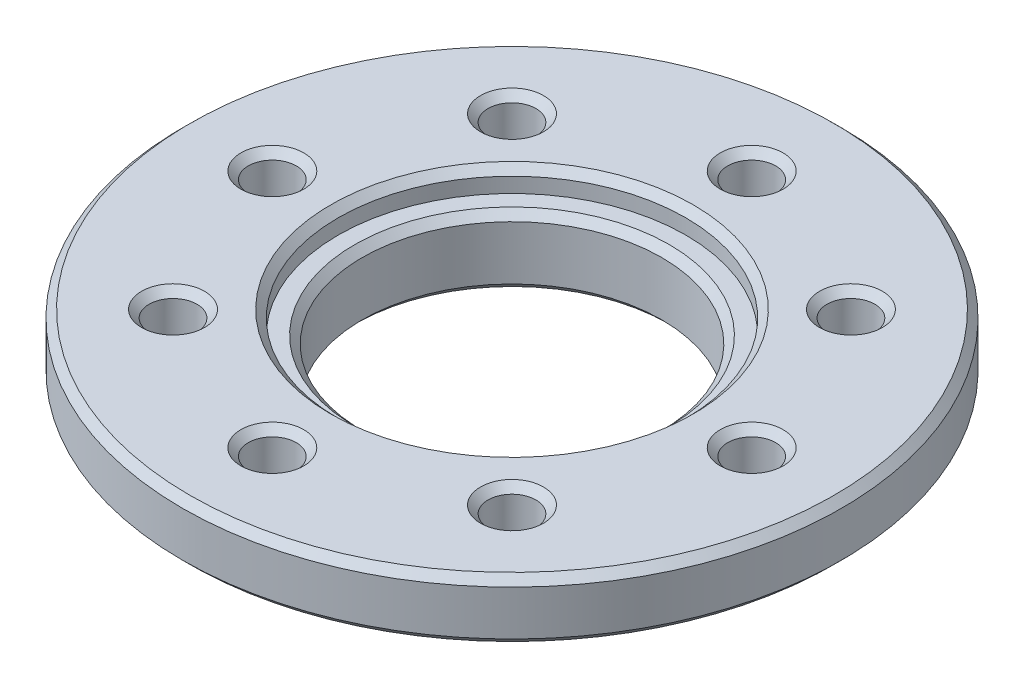
ISO-10303-21;
HEADER;
FILE_DESCRIPTION(('STEP AP214'),'2;1');
FILE_NAME('part.step','',(''),(''),'','','');
FILE_SCHEMA(('AUTOMOTIVE_DESIGN { 1 0 10303 214 1 1 1 1 }'));
ENDSEC;
DATA;
#1=APPLICATION_CONTEXT('core data for automotive mechanical design processes');
#2=APPLICATION_PROTOCOL_DEFINITION('international standard','automotive_design',2000,#1);
#3=PRODUCT_CONTEXT('',#1,'mechanical');
#4=PRODUCT('Part','Part','',(#3));
#5=PRODUCT_RELATED_PRODUCT_CATEGORY('part','',(#4));
#6=PRODUCT_DEFINITION_FORMATION('','',#4);
#7=PRODUCT_DEFINITION_CONTEXT('part definition',#1,'design');
#8=PRODUCT_DEFINITION('design','',#6,#7);
#9=PRODUCT_DEFINITION_SHAPE('','',#8);
#10=(LENGTH_UNIT() NAMED_UNIT(*) SI_UNIT(.MILLI.,.METRE.));
#11=(NAMED_UNIT(*) PLANE_ANGLE_UNIT() SI_UNIT($,.RADIAN.));
#12=(NAMED_UNIT(*) SI_UNIT($,.STERADIAN.) SOLID_ANGLE_UNIT());
#13=UNCERTAINTY_MEASURE_WITH_UNIT(LENGTH_MEASURE(1.E-05),#10,'distance_accuracy_value','');
#14=(GEOMETRIC_REPRESENTATION_CONTEXT(3) GLOBAL_UNCERTAINTY_ASSIGNED_CONTEXT((#13)) GLOBAL_UNIT_ASSIGNED_CONTEXT((#10,
#11,#12)) REPRESENTATION_CONTEXT('',''));
#15=CARTESIAN_POINT('',(0.,0.,0.));
#16=DIRECTION('',(0.,0.,1.));
#17=DIRECTION('',(1.,0.,0.));
#18=AXIS2_PLACEMENT_3D('',#15,#16,#17);
#19=CARTESIAN_POINT('',(0.,-2.,0.));
#20=DIRECTION('',(0.,-1.,0.));
#21=DIRECTION('',(0.,0.,-1.));
#22=AXIS2_PLACEMENT_3D('',#19,#20,#21);
#23=PLANE('',#22);
#24=CARTESIAN_POINT('',(0.,-2.,0.));
#25=DIRECTION('',(0.,-1.,0.));
#26=DIRECTION('',(0.,0.,-1.));
#27=AXIS2_PLACEMENT_3D('',#24,#25,#26);
#28=CIRCLE('',#27,10.7499999999956);
#29=CARTESIAN_POINT('',(0.,-2.,-10.7499999999956));
#30=VERTEX_POINT('',#29);
#31=EDGE_CURVE('E68',#30,#30,#28,.T.);
#32=ORIENTED_EDGE('',*,*,#31,.T.);
#33=EDGE_LOOP('',(#32));
#34=FACE_BOUND('',#33,.T.);
#35=CARTESIAN_POINT('',(0.,-2.,-8.));
#36=DIRECTION('',(0.,-1.,0.));
#37=DIRECTION('',(0.,0.,-1.));
#38=AXIS2_PLACEMENT_3D('',#35,#36,#37);
#39=CIRCLE('',#38,0.799999999999988);
#40=CARTESIAN_POINT('',(0.,-2.,-8.79999999999999));
#41=VERTEX_POINT('',#40);
#42=EDGE_CURVE('E146',#41,#41,#39,.T.);
#43=ORIENTED_EDGE('',*,*,#42,.F.);
#44=EDGE_LOOP('',(#43));
#45=FACE_BOUND('',#44,.T.);
#46=CARTESIAN_POINT('',(5.656854249492,-2.,-5.656854249492));
#47=DIRECTION('',(0.,-1.,0.));
#48=DIRECTION('',(0.,0.,-1.));
#49=AXIS2_PLACEMENT_3D('',#46,#47,#48);
#50=CIRCLE('',#49,0.799999999999988);
#51=CARTESIAN_POINT('',(5.656854249492,-2.,-6.45685424949199));
#52=VERTEX_POINT('',#51);
#53=EDGE_CURVE('E143',#52,#52,#50,.T.);
#54=ORIENTED_EDGE('',*,*,#53,.F.);
#55=EDGE_LOOP('',(#54));
#56=FACE_BOUND('',#55,.T.);
#57=CARTESIAN_POINT('',(8.,-2.,0.));
#58=DIRECTION('',(0.,-1.,0.));
#59=DIRECTION('',(0.,0.,-1.));
#60=AXIS2_PLACEMENT_3D('',#57,#58,#59);
#61=CIRCLE('',#60,0.799999999999988);
#62=CARTESIAN_POINT('',(8.,-2.,-0.799999999999988));
#63=VERTEX_POINT('',#62);
#64=EDGE_CURVE('E140',#63,#63,#61,.T.);
#65=ORIENTED_EDGE('',*,*,#64,.F.);
#66=EDGE_LOOP('',(#65));
#67=FACE_BOUND('',#66,.T.);
#68=CARTESIAN_POINT('',(5.656854249492,-2.,5.656854249492));
#69=DIRECTION('',(0.,-1.,0.));
#70=DIRECTION('',(0.,0.,-1.));
#71=AXIS2_PLACEMENT_3D('',#68,#69,#70);
#72=CIRCLE('',#71,0.799999999999988);
#73=CARTESIAN_POINT('',(5.656854249492,-2.,4.85685424949201));
#74=VERTEX_POINT('',#73);
#75=EDGE_CURVE('E137',#74,#74,#72,.T.);
#76=ORIENTED_EDGE('',*,*,#75,.F.);
#77=EDGE_LOOP('',(#76));
#78=FACE_BOUND('',#77,.T.);
#79=CARTESIAN_POINT('',(0.,-2.,8.));
#80=DIRECTION('',(0.,-1.,0.));
#81=DIRECTION('',(0.,0.,-1.));
#82=AXIS2_PLACEMENT_3D('',#79,#80,#81);
#83=CIRCLE('',#82,0.799999999999988);
#84=CARTESIAN_POINT('',(0.,-2.,7.20000000000001));
#85=VERTEX_POINT('',#84);
#86=EDGE_CURVE('E134',#85,#85,#83,.T.);
#87=ORIENTED_EDGE('',*,*,#86,.F.);
#88=EDGE_LOOP('',(#87));
#89=FACE_BOUND('',#88,.T.);
#90=CARTESIAN_POINT('',(-5.656854249492,-2.,5.656854249492));
#91=DIRECTION('',(0.,-1.,0.));
#92=DIRECTION('',(0.,0.,-1.));
#93=AXIS2_PLACEMENT_3D('',#90,#91,#92);
#94=CIRCLE('',#93,0.799999999999988);
#95=CARTESIAN_POINT('',(-5.656854249492,-2.,4.85685424949201));
#96=VERTEX_POINT('',#95);
#97=EDGE_CURVE('E131',#96,#96,#94,.T.);
#98=ORIENTED_EDGE('',*,*,#97,.F.);
#99=EDGE_LOOP('',(#98));
#100=FACE_BOUND('',#99,.T.);
#101=CARTESIAN_POINT('',(-8.,-2.,0.));
#102=DIRECTION('',(0.,-1.,0.));
#103=DIRECTION('',(0.,0.,-1.));
#104=AXIS2_PLACEMENT_3D('',#101,#102,#103);
#105=CIRCLE('',#104,0.799999999999988);
#106=CARTESIAN_POINT('',(-8.,-2.,-0.799999999999988));
#107=VERTEX_POINT('',#106);
#108=EDGE_CURVE('E128',#107,#107,#105,.T.);
#109=ORIENTED_EDGE('',*,*,#108,.F.);
#110=EDGE_LOOP('',(#109));
#111=FACE_BOUND('',#110,.T.);
#112=CARTESIAN_POINT('',(-5.656854249492,-2.,-5.656854249492));
#113=DIRECTION('',(0.,-1.,0.));
#114=DIRECTION('',(0.,0.,-1.));
#115=AXIS2_PLACEMENT_3D('',#112,#113,#114);
#116=CIRCLE('',#115,0.799999999999988);
#117=CARTESIAN_POINT('',(-5.656854249492,-2.,-6.45685424949199));
#118=VERTEX_POINT('',#117);
#119=EDGE_CURVE('E125',#118,#118,#116,.T.);
#120=ORIENTED_EDGE('',*,*,#119,.F.);
#121=EDGE_LOOP('',(#120));
#122=FACE_BOUND('',#121,.T.);
#123=CARTESIAN_POINT('',(0.,-2.,0.));
#124=DIRECTION('',(0.,-1.,0.));
#125=DIRECTION('',(0.,0.,-1.));
#126=AXIS2_PLACEMENT_3D('',#123,#124,#125);
#127=CIRCLE('',#126,6.25);
#128=CARTESIAN_POINT('',(0.,-2.,-6.25));
#129=VERTEX_POINT('',#128);
#130=EDGE_CURVE('E122',#129,#129,#127,.T.);
#131=ORIENTED_EDGE('',*,*,#130,.F.);
#132=EDGE_LOOP('',(#131));
#133=FACE_BOUND('',#132,.T.);
#134=ADVANCED_FACE('F30',(#34,#45,#56,#67,#78,#89,#100,#111,#122,#133),#23,.T.);
#135=CARTESIAN_POINT('',(0.,0.,0.));
#136=DIRECTION('',(0.,-1.,0.));
#137=DIRECTION('',(0.,0.,-1.));
#138=AXIS2_PLACEMENT_3D('',#135,#136,#137);
#139=CYLINDRICAL_SURFACE('',#138,11.);
#140=CARTESIAN_POINT('',(0.,-1.75000000005246,0.));
#141=DIRECTION('',(0.,-1.,0.));
#142=DIRECTION('',(0.,0.,-1.));
#143=AXIS2_PLACEMENT_3D('',#140,#141,#142);
#144=CIRCLE('',#143,11.);
#145=CARTESIAN_POINT('',(0.,-1.75000000005246,-11.));
#146=VERTEX_POINT('',#145);
#147=EDGE_CURVE('E62',#146,#146,#144,.F.);
#148=ORIENTED_EDGE('',*,*,#147,.T.);
#149=EDGE_LOOP('',(#148));
#150=FACE_BOUND('',#149,.T.);
#151=CARTESIAN_POINT('',(0.,-0.250000000004393,0.));
#152=DIRECTION('',(0.,1.,0.));
#153=DIRECTION('',(0.,0.,1.));
#154=AXIS2_PLACEMENT_3D('',#151,#152,#153);
#155=CIRCLE('',#154,11.);
#156=CARTESIAN_POINT('',(0.,-0.250000000004393,11.));
#157=VERTEX_POINT('',#156);
#158=EDGE_CURVE('E65',#157,#157,#155,.F.);
#159=ORIENTED_EDGE('',*,*,#158,.T.);
#160=EDGE_LOOP('',(#159));
#161=FACE_BOUND('',#160,.T.);
#162=ADVANCED_FACE('F170',(#150,#161),#139,.T.);
#163=CARTESIAN_POINT('',(11.,0.,0.));
#164=DIRECTION('',(0.,1.,0.));
#165=DIRECTION('',(0.,0.,1.));
#166=AXIS2_PLACEMENT_3D('',#163,#164,#165);
#167=PLANE('',#166);
#168=CARTESIAN_POINT('',(8.,0.,0.));
#169=DIRECTION('',(0.,1.,0.));
#170=DIRECTION('',(0.,0.,1.));
#171=AXIS2_PLACEMENT_3D('',#168,#169,#170);
#172=CIRCLE('',#171,1.04999999994754);
#173=CARTESIAN_POINT('',(8.,0.,1.04999999994754));
#174=VERTEX_POINT('',#173);
#175=EDGE_CURVE('E89',#174,#174,#172,.F.);
#176=ORIENTED_EDGE('',*,*,#175,.T.);
#177=EDGE_LOOP('',(#176));
#178=FACE_BOUND('',#177,.T.);
#179=CARTESIAN_POINT('',(-8.,0.,0.));
#180=DIRECTION('',(0.,1.,0.));
#181=DIRECTION('',(0.,0.,1.));
#182=AXIS2_PLACEMENT_3D('',#179,#180,#181);
#183=CIRCLE('',#182,1.04999999994754);
#184=CARTESIAN_POINT('',(-8.,0.,1.04999999994754));
#185=VERTEX_POINT('',#184);
#186=EDGE_CURVE('E92',#185,#185,#183,.F.);
#187=ORIENTED_EDGE('',*,*,#186,.T.);
#188=EDGE_LOOP('',(#187));
#189=FACE_BOUND('',#188,.T.);
#190=CARTESIAN_POINT('',(0.,0.,8.));
#191=DIRECTION('',(0.,1.,0.));
#192=DIRECTION('',(0.,0.,1.));
#193=AXIS2_PLACEMENT_3D('',#190,#191,#192);
#194=CIRCLE('',#193,1.04999999994754);
#195=CARTESIAN_POINT('',(0.,0.,9.04999999994754));
#196=VERTEX_POINT('',#195);
#197=EDGE_CURVE('E95',#196,#196,#194,.F.);
#198=ORIENTED_EDGE('',*,*,#197,.T.);
#199=EDGE_LOOP('',(#198));
#200=FACE_BOUND('',#199,.T.);
#201=CARTESIAN_POINT('',(0.,0.,0.));
#202=DIRECTION('',(0.,1.,0.));
#203=DIRECTION('',(0.,0.,1.));
#204=AXIS2_PLACEMENT_3D('',#201,#202,#203);
#205=CIRCLE('',#204,6.04999999994754);
#206=CARTESIAN_POINT('',(0.,0.,6.04999999994754));
#207=VERTEX_POINT('',#206);
#208=EDGE_CURVE('E98',#207,#207,#205,.F.);
#209=ORIENTED_EDGE('',*,*,#208,.T.);
#210=EDGE_LOOP('',(#209));
#211=FACE_BOUND('',#210,.T.);
#212=CARTESIAN_POINT('',(5.656854249492,0.,5.656854249492));
#213=DIRECTION('',(0.,1.,0.));
#214=DIRECTION('',(0.,0.,1.));
#215=AXIS2_PLACEMENT_3D('',#212,#213,#214);
#216=CIRCLE('',#215,1.04999999994754);
#217=CARTESIAN_POINT('',(5.656854249492,0.,6.70685424943954));
#218=VERTEX_POINT('',#217);
#219=EDGE_CURVE('E101',#218,#218,#216,.F.);
#220=ORIENTED_EDGE('',*,*,#219,.T.);
#221=EDGE_LOOP('',(#220));
#222=FACE_BOUND('',#221,.T.);
#223=CARTESIAN_POINT('',(0.,0.,0.));
#224=DIRECTION('',(0.,1.,0.));
#225=DIRECTION('',(0.,0.,1.));
#226=AXIS2_PLACEMENT_3D('',#223,#224,#225);
#227=CIRCLE('',#226,10.7500000000524);
#228=CARTESIAN_POINT('',(0.,0.,10.7500000000524));
#229=VERTEX_POINT('',#228);
#230=EDGE_CURVE('E104',#229,#229,#227,.T.);
#231=ORIENTED_EDGE('',*,*,#230,.T.);
#232=EDGE_LOOP('',(#231));
#233=FACE_BOUND('',#232,.T.);
#234=CARTESIAN_POINT('',(-5.656854249492,0.,5.656854249492));
#235=DIRECTION('',(0.,1.,0.));
#236=DIRECTION('',(0.,0.,1.));
#237=AXIS2_PLACEMENT_3D('',#234,#235,#236);
#238=CIRCLE('',#237,1.04999999994754);
#239=CARTESIAN_POINT('',(-5.656854249492,0.,6.70685424943954));
#240=VERTEX_POINT('',#239);
#241=EDGE_CURVE('E107',#240,#240,#238,.F.);
#242=ORIENTED_EDGE('',*,*,#241,.T.);
#243=EDGE_LOOP('',(#242));
#244=FACE_BOUND('',#243,.T.);
#245=CARTESIAN_POINT('',(-5.656854249492,0.,-5.656854249492));
#246=DIRECTION('',(0.,1.,0.));
#247=DIRECTION('',(0.,0.,1.));
#248=AXIS2_PLACEMENT_3D('',#245,#246,#247);
#249=CIRCLE('',#248,1.04999999994754);
#250=CARTESIAN_POINT('',(-5.656854249492,0.,-4.60685424954446));
#251=VERTEX_POINT('',#250);
#252=EDGE_CURVE('E110',#251,#251,#249,.F.);
#253=ORIENTED_EDGE('',*,*,#252,.T.);
#254=EDGE_LOOP('',(#253));
#255=FACE_BOUND('',#254,.T.);
#256=CARTESIAN_POINT('',(0.,0.,-8.));
#257=DIRECTION('',(0.,1.,0.));
#258=DIRECTION('',(0.,0.,1.));
#259=AXIS2_PLACEMENT_3D('',#256,#257,#258);
#260=CIRCLE('',#259,1.04999999994754);
#261=CARTESIAN_POINT('',(0.,0.,-6.95000000005246));
#262=VERTEX_POINT('',#261);
#263=EDGE_CURVE('E113',#262,#262,#260,.F.);
#264=ORIENTED_EDGE('',*,*,#263,.T.);
#265=EDGE_LOOP('',(#264));
#266=FACE_BOUND('',#265,.T.);
#267=CARTESIAN_POINT('',(5.656854249492,0.,-5.656854249492));
#268=DIRECTION('',(0.,1.,0.));
#269=DIRECTION('',(0.,0.,1.));
#270=AXIS2_PLACEMENT_3D('',#267,#268,#269);
#271=CIRCLE('',#270,1.04999999994754);
#272=CARTESIAN_POINT('',(5.656854249492,0.,-4.60685424954446));
#273=VERTEX_POINT('',#272);
#274=EDGE_CURVE('E116',#273,#273,#271,.F.);
#275=ORIENTED_EDGE('',*,*,#274,.T.);
#276=EDGE_LOOP('',(#275));
#277=FACE_BOUND('',#276,.T.);
#278=ADVANCED_FACE('F176',(#178,#189,#200,#211,#222,#233,#244,#255,#266,#277),#167,.T.);
#279=CARTESIAN_POINT('',(0.,-3.05,0.));
#280=DIRECTION('',(0.,1.,0.));
#281=DIRECTION('',(0.,0.,1.));
#282=AXIS2_PLACEMENT_3D('',#279,#280,#281);
#283=CYLINDRICAL_SURFACE('',#282,6.25);
#284=CARTESIAN_POINT('',(0.,-2.80000000005244,0.));
#285=DIRECTION('',(0.,-1.,0.));
#286=DIRECTION('',(0.,0.,-1.));
#287=AXIS2_PLACEMENT_3D('',#284,#285,#286);
#288=CIRCLE('',#287,6.25);
#289=CARTESIAN_POINT('',(0.,-2.80000000005244,-6.25));
#290=VERTEX_POINT('',#289);
#291=EDGE_CURVE('E50',#290,#290,#288,.F.);
#292=ORIENTED_EDGE('',*,*,#291,.T.);
#293=EDGE_LOOP('',(#292));
#294=FACE_BOUND('',#293,.T.);
#295=ORIENTED_EDGE('',*,*,#130,.T.);
#296=EDGE_LOOP('',(#295));
#297=FACE_BOUND('',#296,.T.);
#298=ADVANCED_FACE('F182',(#294,#297),#283,.T.);
#299=CARTESIAN_POINT('',(0.,-3.05,0.));
#300=DIRECTION('',(0.,-1.,0.));
#301=DIRECTION('',(0.,0.,-1.));
#302=AXIS2_PLACEMENT_3D('',#299,#300,#301);
#303=PLANE('',#302);
#304=CARTESIAN_POINT('',(0.,-3.05,0.));
#305=DIRECTION('',(0.,-1.,0.));
#306=DIRECTION('',(0.,0.,-1.));
#307=AXIS2_PLACEMENT_3D('',#304,#305,#306);
#308=CIRCLE('',#307,5.25000000000441);
#309=CARTESIAN_POINT('',(0.,-3.05,-5.25000000000441));
#310=VERTEX_POINT('',#309);
#311=EDGE_CURVE('E77',#310,#310,#308,.F.);
#312=ORIENTED_EDGE('',*,*,#311,.T.);
#313=EDGE_LOOP('',(#312));
#314=FACE_BOUND('',#313,.T.);
#315=CARTESIAN_POINT('',(0.,-3.05,0.));
#316=DIRECTION('',(0.,-1.,0.));
#317=DIRECTION('',(0.,0.,-1.));
#318=AXIS2_PLACEMENT_3D('',#315,#316,#317);
#319=CIRCLE('',#318,5.9999999999956);
#320=CARTESIAN_POINT('',(0.,-3.05,-5.9999999999956));
#321=VERTEX_POINT('',#320);
#322=EDGE_CURVE('E80',#321,#321,#319,.T.);
#323=ORIENTED_EDGE('',*,*,#322,.T.);
#324=EDGE_LOOP('',(#323));
#325=FACE_BOUND('',#324,.T.);
#326=ADVANCED_FACE('F274',(#314,#325),#303,.T.);
#327=CARTESIAN_POINT('',(-5.656854249492,0.,-5.656854249492));
#328=DIRECTION('',(0.,1.,0.));
#329=DIRECTION('',(0.,0.,1.));
#330=AXIS2_PLACEMENT_3D('',#327,#328,#329);
#331=CYLINDRICAL_SURFACE('',#330,0.799999999999988);
#332=CARTESIAN_POINT('',(-5.656854249492,-0.250000000004392,-5.656854249492));
#333=DIRECTION('',(0.,1.,0.));
#334=DIRECTION('',(0.,0.,1.));
#335=AXIS2_PLACEMENT_3D('',#332,#333,#334);
#336=CIRCLE('',#335,0.799999999999988);
#337=CARTESIAN_POINT('',(-5.656854249492,-0.250000000004392,-4.85685424949201));
#338=VERTEX_POINT('',#337);
#339=EDGE_CURVE('E45',#338,#338,#336,.T.);
#340=ORIENTED_EDGE('',*,*,#339,.T.);
#341=EDGE_LOOP('',(#340));
#342=FACE_BOUND('',#341,.T.);
#343=ORIENTED_EDGE('',*,*,#119,.T.);
#344=EDGE_LOOP('',(#343));
#345=FACE_BOUND('',#344,.T.);
#346=ADVANCED_FACE('F271',(#342,#345),#331,.F.);
#347=CARTESIAN_POINT('',(-8.,0.,0.));
#348=DIRECTION('',(0.,1.,0.));
#349=DIRECTION('',(0.,0.,1.));
#350=AXIS2_PLACEMENT_3D('',#347,#348,#349);
#351=CYLINDRICAL_SURFACE('',#350,0.799999999999988);
#352=CARTESIAN_POINT('',(-8.,-0.250000000004392,0.));
#353=DIRECTION('',(0.,1.,0.));
#354=DIRECTION('',(0.,0.,1.));
#355=AXIS2_PLACEMENT_3D('',#352,#353,#354);
#356=CIRCLE('',#355,0.799999999999988);
#357=CARTESIAN_POINT('',(-8.,-0.250000000004392,0.799999999999988));
#358=VERTEX_POINT('',#357);
#359=EDGE_CURVE('E86',#358,#358,#356,.T.);
#360=ORIENTED_EDGE('',*,*,#359,.T.);
#361=EDGE_LOOP('',(#360));
#362=FACE_BOUND('',#361,.T.);
#363=ORIENTED_EDGE('',*,*,#108,.T.);
#364=EDGE_LOOP('',(#363));
#365=FACE_BOUND('',#364,.T.);
#366=ADVANCED_FACE('F267',(#362,#365),#351,.F.);
#367=CARTESIAN_POINT('',(-5.656854249492,0.,5.656854249492));
#368=DIRECTION('',(0.,1.,0.));
#369=DIRECTION('',(0.,0.,1.));
#370=AXIS2_PLACEMENT_3D('',#367,#368,#369);
#371=CYLINDRICAL_SURFACE('',#370,0.799999999999988);
#372=CARTESIAN_POINT('',(-5.656854249492,-0.250000000004392,5.656854249492));
#373=DIRECTION('',(0.,1.,0.));
#374=DIRECTION('',(0.,0.,1.));
#375=AXIS2_PLACEMENT_3D('',#372,#373,#374);
#376=CIRCLE('',#375,0.799999999999988);
#377=CARTESIAN_POINT('',(-5.656854249492,-0.250000000004392,6.45685424949199));
#378=VERTEX_POINT('',#377);
#379=EDGE_CURVE('E53',#378,#378,#376,.T.);
#380=ORIENTED_EDGE('',*,*,#379,.T.);
#381=EDGE_LOOP('',(#380));
#382=FACE_BOUND('',#381,.T.);
#383=ORIENTED_EDGE('',*,*,#97,.T.);
#384=EDGE_LOOP('',(#383));
#385=FACE_BOUND('',#384,.T.);
#386=ADVANCED_FACE('F263',(#382,#385),#371,.F.);
#387=CARTESIAN_POINT('',(0.,0.,8.));
#388=DIRECTION('',(0.,1.,0.));
#389=DIRECTION('',(0.,0.,1.));
#390=AXIS2_PLACEMENT_3D('',#387,#388,#389);
#391=CYLINDRICAL_SURFACE('',#390,0.799999999999988);
#392=CARTESIAN_POINT('',(0.,-0.250000000004392,8.));
#393=DIRECTION('',(0.,1.,0.));
#394=DIRECTION('',(0.,0.,1.));
#395=AXIS2_PLACEMENT_3D('',#392,#393,#394);
#396=CIRCLE('',#395,0.799999999999988);
#397=CARTESIAN_POINT('',(0.,-0.250000000004392,8.79999999999999));
#398=VERTEX_POINT('',#397);
#399=EDGE_CURVE('E83',#398,#398,#396,.T.);
#400=ORIENTED_EDGE('',*,*,#399,.T.);
#401=EDGE_LOOP('',(#400));
#402=FACE_BOUND('',#401,.T.);
#403=ORIENTED_EDGE('',*,*,#86,.T.);
#404=EDGE_LOOP('',(#403));
#405=FACE_BOUND('',#404,.T.);
#406=ADVANCED_FACE('F259',(#402,#405),#391,.F.);
#407=CARTESIAN_POINT('',(5.656854249492,0.,5.656854249492));
#408=DIRECTION('',(0.,1.,0.));
#409=DIRECTION('',(0.,0.,1.));
#410=AXIS2_PLACEMENT_3D('',#407,#408,#409);
#411=CYLINDRICAL_SURFACE('',#410,0.799999999999988);
#412=CARTESIAN_POINT('',(5.656854249492,-0.250000000004392,5.656854249492));
#413=DIRECTION('',(0.,1.,0.));
#414=DIRECTION('',(0.,0.,1.));
#415=AXIS2_PLACEMENT_3D('',#412,#413,#414);
#416=CIRCLE('',#415,0.799999999999988);
#417=CARTESIAN_POINT('',(5.656854249492,-0.250000000004392,6.45685424949199));
#418=VERTEX_POINT('',#417);
#419=EDGE_CURVE('E56',#418,#418,#416,.T.);
#420=ORIENTED_EDGE('',*,*,#419,.T.);
#421=EDGE_LOOP('',(#420));
#422=FACE_BOUND('',#421,.T.);
#423=ORIENTED_EDGE('',*,*,#75,.T.);
#424=EDGE_LOOP('',(#423));
#425=FACE_BOUND('',#424,.T.);
#426=ADVANCED_FACE('F255',(#422,#425),#411,.F.);
#427=CARTESIAN_POINT('',(8.,0.,0.));
#428=DIRECTION('',(0.,1.,0.));
#429=DIRECTION('',(0.,0.,1.));
#430=AXIS2_PLACEMENT_3D('',#427,#428,#429);
#431=CYLINDRICAL_SURFACE('',#430,0.799999999999988);
#432=CARTESIAN_POINT('',(8.,-0.250000000004392,0.));
#433=DIRECTION('',(0.,1.,0.));
#434=DIRECTION('',(0.,0.,1.));
#435=AXIS2_PLACEMENT_3D('',#432,#433,#434);
#436=CIRCLE('',#435,0.799999999999988);
#437=CARTESIAN_POINT('',(8.,-0.250000000004392,0.799999999999988));
#438=VERTEX_POINT('',#437);
#439=EDGE_CURVE('E119',#438,#438,#436,.T.);
#440=ORIENTED_EDGE('',*,*,#439,.T.);
#441=EDGE_LOOP('',(#440));
#442=FACE_BOUND('',#441,.T.);
#443=ORIENTED_EDGE('',*,*,#64,.T.);
#444=EDGE_LOOP('',(#443));
#445=FACE_BOUND('',#444,.T.);
#446=ADVANCED_FACE('F252',(#442,#445),#431,.F.);
#447=CARTESIAN_POINT('',(5.656854249492,0.,-5.656854249492));
#448=DIRECTION('',(0.,1.,0.));
#449=DIRECTION('',(0.,0.,1.));
#450=AXIS2_PLACEMENT_3D('',#447,#448,#449);
#451=CYLINDRICAL_SURFACE('',#450,0.799999999999988);
#452=CARTESIAN_POINT('',(5.656854249492,-0.250000000004392,-5.656854249492));
#453=DIRECTION('',(0.,1.,0.));
#454=DIRECTION('',(0.,0.,1.));
#455=AXIS2_PLACEMENT_3D('',#452,#453,#454);
#456=CIRCLE('',#455,0.799999999999988);
#457=CARTESIAN_POINT('',(5.656854249492,-0.250000000004392,-4.85685424949201));
#458=VERTEX_POINT('',#457);
#459=EDGE_CURVE('E10',#458,#458,#456,.T.);
#460=ORIENTED_EDGE('',*,*,#459,.T.);
#461=EDGE_LOOP('',(#460));
#462=FACE_BOUND('',#461,.T.);
#463=ORIENTED_EDGE('',*,*,#53,.T.);
#464=EDGE_LOOP('',(#463));
#465=FACE_BOUND('',#464,.T.);
#466=ADVANCED_FACE('F246',(#462,#465),#451,.F.);
#467=CARTESIAN_POINT('',(0.,0.,-8.));
#468=DIRECTION('',(0.,1.,0.));
#469=DIRECTION('',(0.,0.,1.));
#470=AXIS2_PLACEMENT_3D('',#467,#468,#469);
#471=CYLINDRICAL_SURFACE('',#470,0.799999999999988);
#472=CARTESIAN_POINT('',(0.,-0.250000000004392,-8.));
#473=DIRECTION('',(0.,1.,0.));
#474=DIRECTION('',(0.,0.,1.));
#475=AXIS2_PLACEMENT_3D('',#472,#473,#474);
#476=CIRCLE('',#475,0.799999999999988);
#477=CARTESIAN_POINT('',(0.,-0.250000000004392,-7.20000000000001));
#478=VERTEX_POINT('',#477);
#479=EDGE_CURVE('E41',#478,#478,#476,.T.);
#480=ORIENTED_EDGE('',*,*,#479,.T.);
#481=EDGE_LOOP('',(#480));
#482=FACE_BOUND('',#481,.T.);
#483=ORIENTED_EDGE('',*,*,#42,.T.);
#484=EDGE_LOOP('',(#483));
#485=FACE_BOUND('',#484,.T.);
#486=ADVANCED_FACE('F240',(#482,#485),#471,.F.);
#487=CARTESIAN_POINT('',(0.,0.,0.));
#488=DIRECTION('',(0.,1.,0.));
#489=DIRECTION('',(0.,0.,1.));
#490=AXIS2_PLACEMENT_3D('',#487,#488,#489);
#491=CYLINDRICAL_SURFACE('',#490,5.00000000000001);
#492=CARTESIAN_POINT('',(0.,-2.80000000005244,0.));
#493=DIRECTION('',(0.,-1.,0.));
#494=DIRECTION('',(0.,0.,-1.));
#495=AXIS2_PLACEMENT_3D('',#492,#493,#494);
#496=CIRCLE('',#495,5.00000000000001);
#497=CARTESIAN_POINT('',(0.,-2.80000000005244,-5.00000000000001));
#498=VERTEX_POINT('',#497);
#499=EDGE_CURVE('E71',#498,#498,#496,.T.);
#500=ORIENTED_EDGE('',*,*,#499,.T.);
#501=EDGE_LOOP('',(#500));
#502=FACE_BOUND('',#501,.T.);
#503=CARTESIAN_POINT('',(0.,-1.00000000000439,0.));
#504=DIRECTION('',(0.,-1.,0.));
#505=DIRECTION('',(0.,0.,-1.));
#506=AXIS2_PLACEMENT_3D('',#503,#504,#505);
#507=CIRCLE('',#506,5.00000000000001);
#508=CARTESIAN_POINT('',(0.,-1.00000000000439,-5.00000000000001));
#509=VERTEX_POINT('',#508);
#510=EDGE_CURVE('E74',#509,#509,#507,.F.);
#511=ORIENTED_EDGE('',*,*,#510,.T.);
#512=EDGE_LOOP('',(#511));
#513=FACE_BOUND('',#512,.T.);
#514=ADVANCED_FACE('F167',(#502,#513),#491,.F.);
#515=CARTESIAN_POINT('',(5.00000000000001,-0.750000000000001,0.));
#516=DIRECTION('',(0.,-1.,0.));
#517=DIRECTION('',(0.,0.,-1.));
#518=AXIS2_PLACEMENT_3D('',#515,#516,#517);
#519=PLANE('',#518);
#520=CARTESIAN_POINT('',(0.,-0.750000000000001,0.));
#521=DIRECTION('',(0.,-1.,0.));
#522=DIRECTION('',(0.,0.,-1.));
#523=AXIS2_PLACEMENT_3D('',#520,#521,#522);
#524=CIRCLE('',#523,5.24999999994756);
#525=CARTESIAN_POINT('',(0.,-0.750000000000001,-5.24999999994756));
#526=VERTEX_POINT('',#525);
#527=EDGE_CURVE('E37',#526,#526,#524,.T.);
#528=ORIENTED_EDGE('',*,*,#527,.T.);
#529=EDGE_LOOP('',(#528));
#530=FACE_BOUND('',#529,.T.);
#531=CARTESIAN_POINT('',(0.,-0.750000000000001,0.));
#532=DIRECTION('',(0.,1.,0.));
#533=DIRECTION('',(0.,0.,1.));
#534=AXIS2_PLACEMENT_3D('',#531,#532,#533);
#535=CIRCLE('',#534,5.8);
#536=CARTESIAN_POINT('',(0.,-0.750000000000001,5.8));
#537=VERTEX_POINT('',#536);
#538=EDGE_CURVE('E149',#537,#537,#535,.T.);
#539=ORIENTED_EDGE('',*,*,#538,.T.);
#540=EDGE_LOOP('',(#539));
#541=FACE_BOUND('',#540,.T.);
#542=ADVANCED_FACE('F153',(#530,#541),#519,.F.);
#543=CARTESIAN_POINT('',(0.,0.,0.));
#544=DIRECTION('',(0.,1.,0.));
#545=DIRECTION('',(0.,0.,1.));
#546=AXIS2_PLACEMENT_3D('',#543,#544,#545);
#547=CYLINDRICAL_SURFACE('',#546,5.8);
#548=CARTESIAN_POINT('',(0.,-0.250000000004392,0.));
#549=DIRECTION('',(0.,1.,0.));
#550=DIRECTION('',(0.,0.,1.));
#551=AXIS2_PLACEMENT_3D('',#548,#549,#550);
#552=CIRCLE('',#551,5.8);
#553=CARTESIAN_POINT('',(0.,-0.250000000004392,5.8));
#554=VERTEX_POINT('',#553);
#555=EDGE_CURVE('E59',#554,#554,#552,.T.);
#556=ORIENTED_EDGE('',*,*,#555,.T.);
#557=EDGE_LOOP('',(#556));
#558=FACE_BOUND('',#557,.T.);
#559=ORIENTED_EDGE('',*,*,#538,.F.);
#560=EDGE_LOOP('',(#559));
#561=FACE_BOUND('',#560,.T.);
#562=ADVANCED_FACE('F155',(#558,#561),#547,.F.);
#563=CARTESIAN_POINT('',(8.,-0.250000000004392,0.));
#564=DIRECTION('',(0.,1.,0.));
#565=DIRECTION('',(0.,0.,1.));
#566=AXIS2_PLACEMENT_3D('',#563,#564,#565);
#567=CONICAL_SURFACE('',#566,0.799999999999988,0.785398163283763);
#568=ORIENTED_EDGE('',*,*,#175,.F.);
#569=EDGE_LOOP('',(#568));
#570=FACE_BOUND('',#569,.T.);
#571=ORIENTED_EDGE('',*,*,#439,.F.);
#572=EDGE_LOOP('',(#571));
#573=FACE_BOUND('',#572,.T.);
#574=ADVANCED_FACE('F157',(#570,#573),#567,.F.);
#575=CARTESIAN_POINT('',(-8.,-0.250000000004392,0.));
#576=DIRECTION('',(0.,1.,0.));
#577=DIRECTION('',(0.,0.,1.));
#578=AXIS2_PLACEMENT_3D('',#575,#576,#577);
#579=CONICAL_SURFACE('',#578,0.799999999999988,0.785398163283763);
#580=ORIENTED_EDGE('',*,*,#186,.F.);
#581=EDGE_LOOP('',(#580));
#582=FACE_BOUND('',#581,.T.);
#583=ORIENTED_EDGE('',*,*,#359,.F.);
#584=EDGE_LOOP('',(#583));
#585=FACE_BOUND('',#584,.T.);
#586=ADVANCED_FACE('F164',(#582,#585),#579,.F.);
#587=CARTESIAN_POINT('',(0.,-0.250000000004392,8.));
#588=DIRECTION('',(0.,1.,0.));
#589=DIRECTION('',(0.,0.,1.));
#590=AXIS2_PLACEMENT_3D('',#587,#588,#589);
#591=CONICAL_SURFACE('',#590,0.799999999999988,0.785398163283763);
#592=ORIENTED_EDGE('',*,*,#197,.F.);
#593=EDGE_LOOP('',(#592));
#594=FACE_BOUND('',#593,.T.);
#595=ORIENTED_EDGE('',*,*,#399,.F.);
#596=EDGE_LOOP('',(#595));
#597=FACE_BOUND('',#596,.T.);
#598=ADVANCED_FACE('F189',(#594,#597),#591,.F.);
#599=CARTESIAN_POINT('',(0.,-3.05,0.));
#600=DIRECTION('',(0.,-1.,0.));
#601=DIRECTION('',(0.,0.,-1.));
#602=AXIS2_PLACEMENT_3D('',#599,#600,#601);
#603=CONICAL_SURFACE('',#602,5.25000000000441,0.785398163511128);
#604=ORIENTED_EDGE('',*,*,#499,.F.);
#605=EDGE_LOOP('',(#604));
#606=FACE_BOUND('',#605,.T.);
#607=ORIENTED_EDGE('',*,*,#311,.F.);
#608=EDGE_LOOP('',(#607));
#609=FACE_BOUND('',#608,.T.);
#610=ADVANCED_FACE('F193',(#606,#609),#603,.F.);
#611=CARTESIAN_POINT('',(0.,-2.,0.));
#612=DIRECTION('',(0.,1.,0.));
#613=DIRECTION('',(0.,0.,1.));
#614=AXIS2_PLACEMENT_3D('',#611,#612,#613);
#615=CONICAL_SURFACE('',#614,10.7499999999956,0.785398163511132);
#616=ORIENTED_EDGE('',*,*,#147,.F.);
#617=EDGE_LOOP('',(#616));
#618=FACE_BOUND('',#617,.T.);
#619=ORIENTED_EDGE('',*,*,#31,.F.);
#620=EDGE_LOOP('',(#619));
#621=FACE_BOUND('',#620,.T.);
#622=ADVANCED_FACE('F197',(#618,#621),#615,.T.);
#623=CARTESIAN_POINT('',(0.,-0.250000000004392,0.));
#624=DIRECTION('',(0.,1.,0.));
#625=DIRECTION('',(0.,0.,1.));
#626=AXIS2_PLACEMENT_3D('',#623,#624,#625);
#627=CONICAL_SURFACE('',#626,5.8,0.785398163283763);
#628=ORIENTED_EDGE('',*,*,#208,.F.);
#629=EDGE_LOOP('',(#628));
#630=FACE_BOUND('',#629,.T.);
#631=ORIENTED_EDGE('',*,*,#555,.F.);
#632=EDGE_LOOP('',(#631));
#633=FACE_BOUND('',#632,.T.);
#634=ADVANCED_FACE('F201',(#630,#633),#627,.F.);
#635=CARTESIAN_POINT('',(5.656854249492,-0.250000000004392,5.656854249492));
#636=DIRECTION('',(0.,1.,0.));
#637=DIRECTION('',(0.,0.,1.));
#638=AXIS2_PLACEMENT_3D('',#635,#636,#637);
#639=CONICAL_SURFACE('',#638,0.799999999999988,0.785398163283761);
#640=ORIENTED_EDGE('',*,*,#219,.F.);
#641=EDGE_LOOP('',(#640));
#642=FACE_BOUND('',#641,.T.);
#643=ORIENTED_EDGE('',*,*,#419,.F.);
#644=EDGE_LOOP('',(#643));
#645=FACE_BOUND('',#644,.T.);
#646=ADVANCED_FACE('F205',(#642,#645),#639,.F.);
#647=CARTESIAN_POINT('',(0.,-0.250000000004393,0.));
#648=DIRECTION('',(0.,-1.,0.));
#649=DIRECTION('',(0.,0.,-1.));
#650=AXIS2_PLACEMENT_3D('',#647,#648,#649);
#651=CONICAL_SURFACE('',#650,11.,0.785398163283772);
#652=ORIENTED_EDGE('',*,*,#230,.F.);
#653=EDGE_LOOP('',(#652));
#654=FACE_BOUND('',#653,.T.);
#655=ORIENTED_EDGE('',*,*,#158,.F.);
#656=EDGE_LOOP('',(#655));
#657=FACE_BOUND('',#656,.T.);
#658=ADVANCED_FACE('F209',(#654,#657),#651,.T.);
#659=CARTESIAN_POINT('',(-5.656854249492,-0.250000000004392,5.656854249492));
#660=DIRECTION('',(0.,1.,0.));
#661=DIRECTION('',(0.,0.,1.));
#662=AXIS2_PLACEMENT_3D('',#659,#660,#661);
#663=CONICAL_SURFACE('',#662,0.799999999999988,0.785398163283761);
#664=ORIENTED_EDGE('',*,*,#241,.F.);
#665=EDGE_LOOP('',(#664));
#666=FACE_BOUND('',#665,.T.);
#667=ORIENTED_EDGE('',*,*,#379,.F.);
#668=EDGE_LOOP('',(#667));
#669=FACE_BOUND('',#668,.T.);
#670=ADVANCED_FACE('F213',(#666,#669),#663,.F.);
#671=CARTESIAN_POINT('',(0.,-3.05,0.));
#672=DIRECTION('',(0.,1.,0.));
#673=DIRECTION('',(0.,0.,1.));
#674=AXIS2_PLACEMENT_3D('',#671,#672,#673);
#675=CONICAL_SURFACE('',#674,5.9999999999956,0.785398163511133);
#676=ORIENTED_EDGE('',*,*,#291,.F.);
#677=EDGE_LOOP('',(#676));
#678=FACE_BOUND('',#677,.T.);
#679=ORIENTED_EDGE('',*,*,#322,.F.);
#680=EDGE_LOOP('',(#679));
#681=FACE_BOUND('',#680,.T.);
#682=ADVANCED_FACE('F217',(#678,#681),#675,.T.);
#683=CARTESIAN_POINT('',(-5.656854249492,-0.250000000004392,-5.656854249492));
#684=DIRECTION('',(0.,1.,0.));
#685=DIRECTION('',(0.,0.,1.));
#686=AXIS2_PLACEMENT_3D('',#683,#684,#685);
#687=CONICAL_SURFACE('',#686,0.799999999999988,0.785398163283761);
#688=ORIENTED_EDGE('',*,*,#252,.F.);
#689=EDGE_LOOP('',(#688));
#690=FACE_BOUND('',#689,.T.);
#691=ORIENTED_EDGE('',*,*,#339,.F.);
#692=EDGE_LOOP('',(#691));
#693=FACE_BOUND('',#692,.T.);
#694=ADVANCED_FACE('F221',(#690,#693),#687,.F.);
#695=CARTESIAN_POINT('',(0.,-0.250000000004392,-8.));
#696=DIRECTION('',(0.,1.,0.));
#697=DIRECTION('',(0.,0.,1.));
#698=AXIS2_PLACEMENT_3D('',#695,#696,#697);
#699=CONICAL_SURFACE('',#698,0.799999999999988,0.785398163283763);
#700=ORIENTED_EDGE('',*,*,#263,.F.);
#701=EDGE_LOOP('',(#700));
#702=FACE_BOUND('',#701,.T.);
#703=ORIENTED_EDGE('',*,*,#479,.F.);
#704=EDGE_LOOP('',(#703));
#705=FACE_BOUND('',#704,.T.);
#706=ADVANCED_FACE('F225',(#702,#705),#699,.F.);
#707=CARTESIAN_POINT('',(0.,-1.00000000000439,0.));
#708=DIRECTION('',(0.,1.,0.));
#709=DIRECTION('',(0.,0.,1.));
#710=AXIS2_PLACEMENT_3D('',#707,#708,#709);
#711=CONICAL_SURFACE('',#710,5.00000000000001,0.785398163283768);
#712=ORIENTED_EDGE('',*,*,#527,.F.);
#713=EDGE_LOOP('',(#712));
#714=FACE_BOUND('',#713,.T.);
#715=ORIENTED_EDGE('',*,*,#510,.F.);
#716=EDGE_LOOP('',(#715));
#717=FACE_BOUND('',#716,.T.);
#718=ADVANCED_FACE('F228',(#714,#717),#711,.F.);
#719=CARTESIAN_POINT('',(5.656854249492,-0.250000000004392,-5.656854249492));
#720=DIRECTION('',(0.,1.,0.));
#721=DIRECTION('',(0.,0.,1.));
#722=AXIS2_PLACEMENT_3D('',#719,#720,#721);
#723=CONICAL_SURFACE('',#722,0.799999999999988,0.785398163283761);
#724=ORIENTED_EDGE('',*,*,#274,.F.);
#725=EDGE_LOOP('',(#724));
#726=FACE_BOUND('',#725,.T.);
#727=ORIENTED_EDGE('',*,*,#459,.F.);
#728=EDGE_LOOP('',(#727));
#729=FACE_BOUND('',#728,.T.);
#730=ADVANCED_FACE('F32',(#726,#729),#723,.F.);
#731=CLOSED_SHELL('',(#134,#162,#278,#298,#326,#346,#366,#386,#406,#426,#446,#466,#486,#514,
#542,#562,#574,#586,#598,#610,#622,#634,#646,#658,#670,#682,#694,#706,#718,#730));
#732=MANIFOLD_SOLID_BREP('B2',#731);
#733=ADVANCED_BREP_SHAPE_REPRESENTATION('',(#18,#732),#14);
#734=SHAPE_DEFINITION_REPRESENTATION(#9,#733);
ENDSEC;
END-ISO-10303-21;
